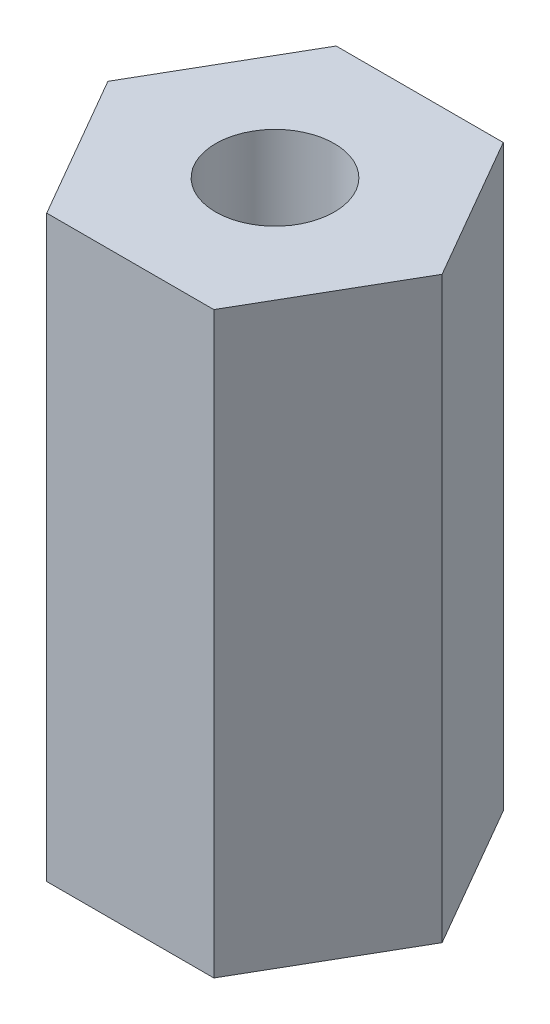
ISO-10303-21;
HEADER;
FILE_DESCRIPTION(('STEP AP214'),'2;1');
FILE_NAME('part.step','',(''),(''),'','','');
FILE_SCHEMA(('AUTOMOTIVE_DESIGN { 1 0 10303 214 1 1 1 1 }'));
ENDSEC;
DATA;
#1=APPLICATION_CONTEXT('core data for automotive mechanical design processes');
#2=APPLICATION_PROTOCOL_DEFINITION('international standard','automotive_design',2000,#1);
#3=PRODUCT_CONTEXT('',#1,'mechanical');
#4=PRODUCT('Part','Part','',(#3));
#5=PRODUCT_RELATED_PRODUCT_CATEGORY('part','',(#4));
#6=PRODUCT_DEFINITION_FORMATION('','',#4);
#7=PRODUCT_DEFINITION_CONTEXT('part definition',#1,'design');
#8=PRODUCT_DEFINITION('design','',#6,#7);
#9=PRODUCT_DEFINITION_SHAPE('','',#8);
#10=(LENGTH_UNIT() NAMED_UNIT(*) SI_UNIT(.MILLI.,.METRE.));
#11=(NAMED_UNIT(*) PLANE_ANGLE_UNIT() SI_UNIT($,.RADIAN.));
#12=(NAMED_UNIT(*) SI_UNIT($,.STERADIAN.) SOLID_ANGLE_UNIT());
#13=UNCERTAINTY_MEASURE_WITH_UNIT(LENGTH_MEASURE(1.E-05),#10,'distance_accuracy_value','');
#14=(GEOMETRIC_REPRESENTATION_CONTEXT(3) GLOBAL_UNCERTAINTY_ASSIGNED_CONTEXT((#13)) GLOBAL_UNIT_ASSIGNED_CONTEXT((#10,
#11,#12)) REPRESENTATION_CONTEXT('',''));
#15=CARTESIAN_POINT('',(0.,0.,0.));
#16=DIRECTION('',(0.,0.,1.));
#17=DIRECTION('',(1.,0.,0.));
#18=AXIS2_PLACEMENT_3D('',#15,#16,#17);
#19=CARTESIAN_POINT('',(1.443375673,10.,2.5));
#20=DIRECTION('',(-0.866025403838329,0.,-0.499999999906659));
#21=DIRECTION('',(-0.499999999906659,0.,0.866025403838329));
#22=AXIS2_PLACEMENT_3D('',#19,#20,#21);
#23=PLANE('',#22);
#24=DIRECTION('',(0.500000000006738,0.,-0.866025403780548));
#25=VECTOR('',#24,1.);
#26=CARTESIAN_POINT('',(1.443375673,10.,2.5));
#27=LINE('',#26,#25);
#28=CARTESIAN_POINT('',(1.443375673,10.,2.5));
#29=VERTEX_POINT('',#28);
#30=CARTESIAN_POINT('',(2.88675134585555,10.,-8.33995045868235E-11));
#31=VERTEX_POINT('',#30);
#32=EDGE_CURVE('E70',#29,#31,#27,.T.);
#33=ORIENTED_EDGE('',*,*,#32,.F.);
#34=DIRECTION('',(0.,1.,0.));
#35=VECTOR('',#34,1.);
#36=CARTESIAN_POINT('',(1.443375673,10.,2.5));
#37=LINE('',#36,#35);
#38=CARTESIAN_POINT('',(1.443375673,0.,2.5));
#39=VERTEX_POINT('',#38);
#40=EDGE_CURVE('E67',#39,#29,#37,.T.);
#41=ORIENTED_EDGE('',*,*,#40,.F.);
#42=DIRECTION('',(-0.500000000006738,0.,0.866025403780548));
#43=VECTOR('',#42,1.);
#44=CARTESIAN_POINT('',(2.886751346,0.,0.));
#45=LINE('',#44,#43);
#46=CARTESIAN_POINT('',(2.88675134585555,0.,-8.33993789826903E-11));
#47=VERTEX_POINT('',#46);
#48=EDGE_CURVE('E64',#47,#39,#45,.T.);
#49=ORIENTED_EDGE('',*,*,#48,.F.);
#50=DIRECTION('',(0.,1.,0.));
#51=VECTOR('',#50,1.);
#52=CARTESIAN_POINT('',(2.886751346,10.,0.));
#53=LINE('',#52,#51);
#54=EDGE_CURVE('E96',#31,#47,#53,.F.);
#55=ORIENTED_EDGE('',*,*,#54,.F.);
#56=EDGE_LOOP('',(#33,#41,#49,#55));
#57=FACE_BOUND('',#56,.T.);
#58=ADVANCED_FACE('F16',(#57),#23,.F.);
#59=CARTESIAN_POINT('',(2.886751346,10.,0.));
#60=DIRECTION('',(-0.866025403838329,0.,0.499999999906659));
#61=DIRECTION('',(0.499999999906659,0.,0.866025403838329));
#62=AXIS2_PLACEMENT_3D('',#59,#60,#61);
#63=PLANE('',#62);
#64=DIRECTION('',(-0.500000000006738,0.,-0.866025403780548));
#65=VECTOR('',#64,1.);
#66=CARTESIAN_POINT('',(2.886751346,10.,0.));
#67=LINE('',#66,#65);
#68=CARTESIAN_POINT('',(1.44337567314445,10.,-2.5000000000834));
#69=VERTEX_POINT('',#68);
#70=EDGE_CURVE('E101',#31,#69,#67,.T.);
#71=ORIENTED_EDGE('',*,*,#70,.F.);
#72=ORIENTED_EDGE('',*,*,#54,.T.);
#73=DIRECTION('',(0.500000000006738,0.,0.866025403780548));
#74=VECTOR('',#73,1.);
#75=CARTESIAN_POINT('',(1.443375673,0.,-2.5));
#76=LINE('',#75,#74);
#77=CARTESIAN_POINT('',(1.44337567307223,0.,-2.5000000000417));
#78=VERTEX_POINT('',#77);
#79=EDGE_CURVE('E86',#78,#47,#76,.T.);
#80=ORIENTED_EDGE('',*,*,#79,.F.);
#81=DIRECTION('',(0.,1.,0.));
#82=VECTOR('',#81,1.);
#83=CARTESIAN_POINT('',(1.443375673,10.,-2.5));
#84=LINE('',#83,#82);
#85=EDGE_CURVE('E94',#69,#78,#84,.F.);
#86=ORIENTED_EDGE('',*,*,#85,.F.);
#87=EDGE_LOOP('',(#71,#72,#80,#86));
#88=FACE_BOUND('',#87,.T.);
#89=ADVANCED_FACE('F99',(#88),#63,.F.);
#90=CARTESIAN_POINT('',(1.443375673,10.,-2.5));
#91=DIRECTION('',(0.,0.,1.));
#92=DIRECTION('',(1.,0.,0.));
#93=AXIS2_PLACEMENT_3D('',#90,#91,#92);
#94=PLANE('',#93);
#95=DIRECTION('',(1.,0.,0.));
#96=VECTOR('',#95,1.);
#97=CARTESIAN_POINT('',(0.,10.,-2.5));
#98=LINE('',#97,#96);
#99=CARTESIAN_POINT('',(-1.443375673,10.,-2.5));
#100=VERTEX_POINT('',#99);
#101=EDGE_CURVE('E105',#69,#100,#98,.F.);
#102=ORIENTED_EDGE('',*,*,#101,.F.);
#103=ORIENTED_EDGE('',*,*,#85,.T.);
#104=DIRECTION('',(1.,0.,0.));
#105=VECTOR('',#104,1.);
#106=CARTESIAN_POINT('',(0.,0.,-2.5));
#107=LINE('',#106,#105);
#108=CARTESIAN_POINT('',(-1.443375673,0.,-2.5));
#109=VERTEX_POINT('',#108);
#110=EDGE_CURVE('E111',#109,#78,#107,.T.);
#111=ORIENTED_EDGE('',*,*,#110,.F.);
#112=DIRECTION('',(0.,1.,0.));
#113=VECTOR('',#112,1.);
#114=CARTESIAN_POINT('',(-1.443375673,10.,-2.5));
#115=LINE('',#114,#113);
#116=EDGE_CURVE('E92',#100,#109,#115,.F.);
#117=ORIENTED_EDGE('',*,*,#116,.F.);
#118=EDGE_LOOP('',(#102,#103,#111,#117));
#119=FACE_BOUND('',#118,.T.);
#120=ADVANCED_FACE('F128',(#119),#94,.F.);
#121=CARTESIAN_POINT('',(-1.443375673,10.,-2.5));
#122=DIRECTION('',(0.866025403838329,0.,0.499999999906659));
#123=DIRECTION('',(0.499999999906659,0.,-0.866025403838329));
#124=AXIS2_PLACEMENT_3D('',#121,#122,#123);
#125=PLANE('',#124);
#126=DIRECTION('',(-0.500000000006738,0.,0.866025403780548));
#127=VECTOR('',#126,1.);
#128=CARTESIAN_POINT('',(-1.443375673,10.,-2.5));
#129=LINE('',#128,#127);
#130=CARTESIAN_POINT('',(-2.88675134585555,10.,8.33995045868235E-11));
#131=VERTEX_POINT('',#130);
#132=EDGE_CURVE('E126',#100,#131,#129,.T.);
#133=ORIENTED_EDGE('',*,*,#132,.F.);
#134=ORIENTED_EDGE('',*,*,#116,.T.);
#135=DIRECTION('',(0.500000000006738,0.,-0.866025403780548));
#136=VECTOR('',#135,1.);
#137=CARTESIAN_POINT('',(-2.886751346,0.,0.));
#138=LINE('',#137,#136);
#139=CARTESIAN_POINT('',(-2.88675134592777,0.,4.16996623862909E-11));
#140=VERTEX_POINT('',#139);
#141=EDGE_CURVE('E116',#140,#109,#138,.T.);
#142=ORIENTED_EDGE('',*,*,#141,.F.);
#143=DIRECTION('',(0.,1.,0.));
#144=VECTOR('',#143,1.);
#145=CARTESIAN_POINT('',(-2.886751346,10.,0.));
#146=LINE('',#145,#144);
#147=EDGE_CURVE('E73',#131,#140,#146,.F.);
#148=ORIENTED_EDGE('',*,*,#147,.F.);
#149=EDGE_LOOP('',(#133,#134,#142,#148));
#150=FACE_BOUND('',#149,.T.);
#151=ADVANCED_FACE('F124',(#150),#125,.F.);
#152=CARTESIAN_POINT('',(-2.886751346,10.,0.));
#153=DIRECTION('',(0.866025403838329,0.,-0.499999999906659));
#154=DIRECTION('',(-0.499999999906659,0.,-0.866025403838329));
#155=AXIS2_PLACEMENT_3D('',#152,#153,#154);
#156=PLANE('',#155);
#157=DIRECTION('',(0.500000000006738,0.,0.866025403780548));
#158=VECTOR('',#157,1.);
#159=CARTESIAN_POINT('',(-2.886751346,10.,0.));
#160=LINE('',#159,#158);
#161=CARTESIAN_POINT('',(-1.44337567314445,10.,2.5000000000834));
#162=VERTEX_POINT('',#161);
#163=EDGE_CURVE('E120',#131,#162,#160,.T.);
#164=ORIENTED_EDGE('',*,*,#163,.F.);
#165=ORIENTED_EDGE('',*,*,#147,.T.);
#166=DIRECTION('',(-0.500000000006738,0.,-0.866025403780548));
#167=VECTOR('',#166,1.);
#168=CARTESIAN_POINT('',(-1.443375673,0.,2.5));
#169=LINE('',#168,#167);
#170=CARTESIAN_POINT('',(-1.44337567307223,0.,2.5000000000417));
#171=VERTEX_POINT('',#170);
#172=EDGE_CURVE('E80',#171,#140,#169,.T.);
#173=ORIENTED_EDGE('',*,*,#172,.F.);
#174=DIRECTION('',(0.,1.,0.));
#175=VECTOR('',#174,1.);
#176=CARTESIAN_POINT('',(-1.443375673,10.,2.5));
#177=LINE('',#176,#175);
#178=EDGE_CURVE('E32',#162,#171,#177,.F.);
#179=ORIENTED_EDGE('',*,*,#178,.F.);
#180=EDGE_LOOP('',(#164,#165,#173,#179));
#181=FACE_BOUND('',#180,.T.);
#182=ADVANCED_FACE('F119',(#181),#156,.F.);
#183=CARTESIAN_POINT('',(-1.443375673,10.,2.5));
#184=DIRECTION('',(0.,0.,-1.));
#185=DIRECTION('',(-1.,0.,0.));
#186=AXIS2_PLACEMENT_3D('',#183,#184,#185);
#187=PLANE('',#186);
#188=DIRECTION('',(1.,0.,0.));
#189=VECTOR('',#188,1.);
#190=CARTESIAN_POINT('',(0.,10.,2.5));
#191=LINE('',#190,#189);
#192=EDGE_CURVE('E109',#162,#29,#191,.T.);
#193=ORIENTED_EDGE('',*,*,#192,.F.);
#194=ORIENTED_EDGE('',*,*,#178,.T.);
#195=DIRECTION('',(1.,0.,0.));
#196=VECTOR('',#195,1.);
#197=CARTESIAN_POINT('',(0.,0.,2.5));
#198=LINE('',#197,#196);
#199=EDGE_CURVE('E76',#39,#171,#198,.F.);
#200=ORIENTED_EDGE('',*,*,#199,.F.);
#201=ORIENTED_EDGE('',*,*,#40,.T.);
#202=EDGE_LOOP('',(#193,#194,#200,#201));
#203=FACE_BOUND('',#202,.T.);
#204=ADVANCED_FACE('F77',(#203),#187,.F.);
#205=CARTESIAN_POINT('',(0.,0.,0.));
#206=DIRECTION('',(0.,1.,0.));
#207=DIRECTION('',(0.,0.,1.));
#208=AXIS2_PLACEMENT_3D('',#205,#206,#207);
#209=PLANE('',#208);
#210=CARTESIAN_POINT('',(0.,0.,0.));
#211=DIRECTION('',(0.,1.,0.));
#212=DIRECTION('',(0.,0.,1.));
#213=AXIS2_PLACEMENT_3D('',#210,#211,#212);
#214=CIRCLE('',#213,1.025);
#215=CARTESIAN_POINT('',(0.,0.,1.025));
#216=VERTEX_POINT('',#215);
#217=EDGE_CURVE('E19',#216,#216,#214,.F.);
#218=ORIENTED_EDGE('',*,*,#217,.F.);
#219=EDGE_LOOP('',(#218));
#220=FACE_BOUND('',#219,.T.);
#221=ORIENTED_EDGE('',*,*,#110,.T.);
#222=ORIENTED_EDGE('',*,*,#79,.T.);
#223=ORIENTED_EDGE('',*,*,#48,.T.);
#224=ORIENTED_EDGE('',*,*,#199,.T.);
#225=ORIENTED_EDGE('',*,*,#172,.T.);
#226=ORIENTED_EDGE('',*,*,#141,.T.);
#227=EDGE_LOOP('',(#221,#222,#223,#224,#225,#226));
#228=FACE_BOUND('',#227,.T.);
#229=ADVANCED_FACE('F84',(#220,#228),#209,.F.);
#230=CARTESIAN_POINT('',(0.,10.,0.));
#231=DIRECTION('',(0.,1.,0.));
#232=DIRECTION('',(0.,0.,1.));
#233=AXIS2_PLACEMENT_3D('',#230,#231,#232);
#234=PLANE('',#233);
#235=CARTESIAN_POINT('',(0.,10.,0.));
#236=DIRECTION('',(0.,1.,0.));
#237=DIRECTION('',(0.,0.,1.));
#238=AXIS2_PLACEMENT_3D('',#235,#236,#237);
#239=CIRCLE('',#238,1.025);
#240=CARTESIAN_POINT('',(0.,10.,1.025));
#241=VERTEX_POINT('',#240);
#242=EDGE_CURVE('E11',#241,#241,#239,.T.);
#243=ORIENTED_EDGE('',*,*,#242,.F.);
#244=EDGE_LOOP('',(#243));
#245=FACE_BOUND('',#244,.T.);
#246=ORIENTED_EDGE('',*,*,#163,.T.);
#247=ORIENTED_EDGE('',*,*,#192,.T.);
#248=ORIENTED_EDGE('',*,*,#32,.T.);
#249=ORIENTED_EDGE('',*,*,#70,.T.);
#250=ORIENTED_EDGE('',*,*,#101,.T.);
#251=ORIENTED_EDGE('',*,*,#132,.T.);
#252=EDGE_LOOP('',(#246,#247,#248,#249,#250,#251));
#253=FACE_BOUND('',#252,.T.);
#254=ADVANCED_FACE('F108',(#245,#253),#234,.T.);
#255=CARTESIAN_POINT('',(0.,0.,0.));
#256=DIRECTION('',(0.,1.,0.));
#257=DIRECTION('',(0.,0.,1.));
#258=AXIS2_PLACEMENT_3D('',#255,#256,#257);
#259=CYLINDRICAL_SURFACE('',#258,1.025);
#260=ORIENTED_EDGE('',*,*,#242,.T.);
#261=EDGE_LOOP('',(#260));
#262=FACE_BOUND('',#261,.T.);
#263=ORIENTED_EDGE('',*,*,#217,.T.);
#264=EDGE_LOOP('',(#263));
#265=FACE_BOUND('',#264,.T.);
#266=ADVANCED_FACE('F135',(#262,#265),#259,.F.);
#267=CLOSED_SHELL('',(#58,#89,#120,#151,#182,#204,#229,#254,#266));
#268=MANIFOLD_SOLID_BREP('B1',#267);
#269=ADVANCED_BREP_SHAPE_REPRESENTATION('',(#18,#268),#14);
#270=SHAPE_DEFINITION_REPRESENTATION(#9,#269);
ENDSEC;
END-ISO-10303-21;
